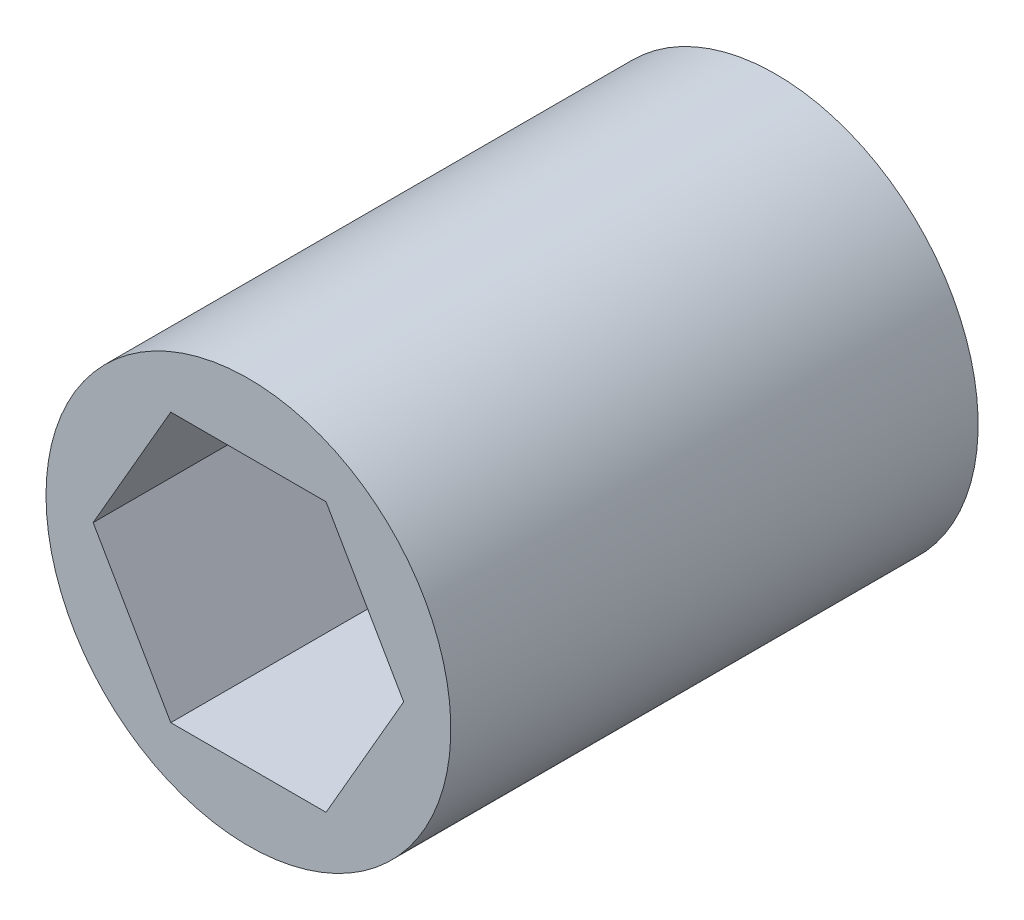
ISO-10303-21;
HEADER;
FILE_DESCRIPTION(('STEP AP214'),'2;1');
FILE_NAME('part.step','',(''),(''),'','','');
FILE_SCHEMA(('AUTOMOTIVE_DESIGN { 1 0 10303 214 1 1 1 1 }'));
ENDSEC;
DATA;
#1=APPLICATION_CONTEXT('core data for automotive mechanical design processes');
#2=APPLICATION_PROTOCOL_DEFINITION('international standard','automotive_design',2000,#1);
#3=PRODUCT_CONTEXT('',#1,'mechanical');
#4=PRODUCT('Part','Part','',(#3));
#5=PRODUCT_RELATED_PRODUCT_CATEGORY('part','',(#4));
#6=PRODUCT_DEFINITION_FORMATION('','',#4);
#7=PRODUCT_DEFINITION_CONTEXT('part definition',#1,'design');
#8=PRODUCT_DEFINITION('design','',#6,#7);
#9=PRODUCT_DEFINITION_SHAPE('','',#8);
#10=(LENGTH_UNIT() NAMED_UNIT(*) SI_UNIT(.MILLI.,.METRE.));
#11=(NAMED_UNIT(*) PLANE_ANGLE_UNIT() SI_UNIT($,.RADIAN.));
#12=(NAMED_UNIT(*) SI_UNIT($,.STERADIAN.) SOLID_ANGLE_UNIT());
#13=UNCERTAINTY_MEASURE_WITH_UNIT(LENGTH_MEASURE(1.E-05),#10,'distance_accuracy_value','');
#14=(GEOMETRIC_REPRESENTATION_CONTEXT(3) GLOBAL_UNCERTAINTY_ASSIGNED_CONTEXT((#13)) GLOBAL_UNIT_ASSIGNED_CONTEXT((#10,
#11,#12)) REPRESENTATION_CONTEXT('',''));
#15=CARTESIAN_POINT('',(0.,0.,0.));
#16=DIRECTION('',(0.,0.,1.));
#17=DIRECTION('',(1.,0.,0.));
#18=AXIS2_PLACEMENT_3D('',#15,#16,#17);
#19=CARTESIAN_POINT('',(-7.47899538708241,0.,12.7));
#20=DIRECTION('',(0.866025403784439,0.5,0.));
#21=DIRECTION('',(-0.5,0.866025403784439,0.));
#22=AXIS2_PLACEMENT_3D('',#19,#20,#21);
#23=PLANE('',#22);
#24=DIRECTION('',(-0.5,0.866025403784438,0.));
#25=VECTOR('',#24,1.);
#26=CARTESIAN_POINT('',(-3.73949769354121,-6.477,12.7));
#27=LINE('',#26,#25);
#28=CARTESIAN_POINT('',(-3.73949769354121,-6.477,12.7));
#29=VERTEX_POINT('',#28);
#30=CARTESIAN_POINT('',(-7.47899538708241,0.,12.7));
#31=VERTEX_POINT('',#30);
#32=EDGE_CURVE('E92',#29,#31,#27,.T.);
#33=ORIENTED_EDGE('',*,*,#32,.F.);
#34=DIRECTION('',(0.,0.,1.));
#35=VECTOR('',#34,1.);
#36=CARTESIAN_POINT('',(-3.73949769354121,-6.477,12.7));
#37=LINE('',#36,#35);
#38=CARTESIAN_POINT('',(-3.73949769354121,-6.477,-12.7));
#39=VERTEX_POINT('',#38);
#40=EDGE_CURVE('E84',#39,#29,#37,.T.);
#41=ORIENTED_EDGE('',*,*,#40,.F.);
#42=DIRECTION('',(-0.5,0.866025403784439,0.));
#43=VECTOR('',#42,1.);
#44=CARTESIAN_POINT('',(-3.73949769354121,-6.477,-12.7));
#45=LINE('',#44,#43);
#46=CARTESIAN_POINT('',(-7.47899538708241,0.,-12.7));
#47=VERTEX_POINT('',#46);
#48=EDGE_CURVE('E124',#39,#47,#45,.T.);
#49=ORIENTED_EDGE('',*,*,#48,.T.);
#50=DIRECTION('',(0.,0.,1.));
#51=VECTOR('',#50,1.);
#52=CARTESIAN_POINT('',(-7.47899538708241,0.,12.7));
#53=LINE('',#52,#51);
#54=EDGE_CURVE('E109',#31,#47,#53,.F.);
#55=ORIENTED_EDGE('',*,*,#54,.F.);
#56=EDGE_LOOP('',(#33,#41,#49,#55));
#57=FACE_BOUND('',#56,.T.);
#58=ADVANCED_FACE('F25',(#57),#23,.T.);
#59=CARTESIAN_POINT('',(-3.73949769354121,6.477,12.7));
#60=DIRECTION('',(0.866025403784439,-0.5,0.));
#61=DIRECTION('',(0.5,0.866025403784439,0.));
#62=AXIS2_PLACEMENT_3D('',#59,#60,#61);
#63=PLANE('',#62);
#64=DIRECTION('',(0.5,0.866025403784439,0.));
#65=VECTOR('',#64,1.);
#66=CARTESIAN_POINT('',(-7.47899538708242,0.,12.7));
#67=LINE('',#66,#65);
#68=CARTESIAN_POINT('',(-3.73949769354121,6.477,12.7));
#69=VERTEX_POINT('',#68);
#70=EDGE_CURVE('E117',#31,#69,#67,.T.);
#71=ORIENTED_EDGE('',*,*,#70,.F.);
#72=ORIENTED_EDGE('',*,*,#54,.T.);
#73=DIRECTION('',(0.5,0.866025403784439,0.));
#74=VECTOR('',#73,1.);
#75=CARTESIAN_POINT('',(-7.47899538708241,0.,-12.7));
#76=LINE('',#75,#74);
#77=CARTESIAN_POINT('',(-3.73949769354121,6.477,-12.7));
#78=VERTEX_POINT('',#77);
#79=EDGE_CURVE('E115',#47,#78,#76,.T.);
#80=ORIENTED_EDGE('',*,*,#79,.T.);
#81=DIRECTION('',(0.,0.,1.));
#82=VECTOR('',#81,1.);
#83=CARTESIAN_POINT('',(-3.73949769354121,6.477,12.7));
#84=LINE('',#83,#82);
#85=EDGE_CURVE('E106',#69,#78,#84,.F.);
#86=ORIENTED_EDGE('',*,*,#85,.F.);
#87=EDGE_LOOP('',(#71,#72,#80,#86));
#88=FACE_BOUND('',#87,.T.);
#89=ADVANCED_FACE('F114',(#88),#63,.T.);
#90=CARTESIAN_POINT('',(3.7394976935412,6.477,12.7));
#91=DIRECTION('',(0.,-1.,0.));
#92=DIRECTION('',(1.,0.,0.));
#93=AXIS2_PLACEMENT_3D('',#90,#91,#92);
#94=PLANE('',#93);
#95=DIRECTION('',(1.,0.,0.));
#96=VECTOR('',#95,1.);
#97=CARTESIAN_POINT('',(0.,6.477,12.7));
#98=LINE('',#97,#96);
#99=CARTESIAN_POINT('',(3.7394976935412,6.477,12.7));
#100=VERTEX_POINT('',#99);
#101=EDGE_CURVE('E134',#69,#100,#98,.T.);
#102=ORIENTED_EDGE('',*,*,#101,.F.);
#103=ORIENTED_EDGE('',*,*,#85,.T.);
#104=DIRECTION('',(1.,0.,0.));
#105=VECTOR('',#104,1.);
#106=CARTESIAN_POINT('',(0.,6.477,-12.7));
#107=LINE('',#106,#105);
#108=CARTESIAN_POINT('',(3.7394976935412,6.477,-12.7));
#109=VERTEX_POINT('',#108);
#110=EDGE_CURVE('E126',#78,#109,#107,.T.);
#111=ORIENTED_EDGE('',*,*,#110,.T.);
#112=DIRECTION('',(0.,0.,1.));
#113=VECTOR('',#112,1.);
#114=CARTESIAN_POINT('',(3.7394976935412,6.47700000000001,12.7));
#115=LINE('',#114,#113);
#116=EDGE_CURVE('E103',#100,#109,#115,.F.);
#117=ORIENTED_EDGE('',*,*,#116,.F.);
#118=EDGE_LOOP('',(#102,#103,#111,#117));
#119=FACE_BOUND('',#118,.T.);
#120=ADVANCED_FACE('F143',(#119),#94,.T.);
#121=CARTESIAN_POINT('',(7.47899538708241,0.,12.7));
#122=DIRECTION('',(-0.866025403784439,-0.5,0.));
#123=DIRECTION('',(0.5,-0.866025403784439,0.));
#124=AXIS2_PLACEMENT_3D('',#121,#122,#123);
#125=PLANE('',#124);
#126=DIRECTION('',(0.5,-0.866025403784438,0.));
#127=VECTOR('',#126,1.);
#128=CARTESIAN_POINT('',(3.7394976935412,6.477,12.7));
#129=LINE('',#128,#127);
#130=CARTESIAN_POINT('',(7.47899538708242,0.,12.7));
#131=VERTEX_POINT('',#130);
#132=EDGE_CURVE('E97',#100,#131,#129,.T.);
#133=ORIENTED_EDGE('',*,*,#132,.F.);
#134=ORIENTED_EDGE('',*,*,#116,.T.);
#135=DIRECTION('',(0.5,-0.866025403784438,0.));
#136=VECTOR('',#135,1.);
#137=CARTESIAN_POINT('',(3.7394976935412,6.477,-12.7));
#138=LINE('',#137,#136);
#139=CARTESIAN_POINT('',(7.47899538708241,0.,-12.7));
#140=VERTEX_POINT('',#139);
#141=EDGE_CURVE('E128',#109,#140,#138,.T.);
#142=ORIENTED_EDGE('',*,*,#141,.T.);
#143=DIRECTION('',(0.,0.,1.));
#144=VECTOR('',#143,1.);
#145=CARTESIAN_POINT('',(7.47899538708242,0.,12.7));
#146=LINE('',#145,#144);
#147=EDGE_CURVE('E73',#131,#140,#146,.F.);
#148=ORIENTED_EDGE('',*,*,#147,.F.);
#149=EDGE_LOOP('',(#133,#134,#142,#148));
#150=FACE_BOUND('',#149,.T.);
#151=ADVANCED_FACE('F140',(#150),#125,.T.);
#152=CARTESIAN_POINT('',(3.73949769354121,-6.477,12.7));
#153=DIRECTION('',(-0.866025403784439,0.5,0.));
#154=DIRECTION('',(-0.5,-0.866025403784439,0.));
#155=AXIS2_PLACEMENT_3D('',#152,#153,#154);
#156=PLANE('',#155);
#157=DIRECTION('',(-0.5,-0.866025403784439,0.));
#158=VECTOR('',#157,1.);
#159=CARTESIAN_POINT('',(7.47899538708241,0.,12.7));
#160=LINE('',#159,#158);
#161=CARTESIAN_POINT('',(3.73949769354121,-6.477,12.7));
#162=VERTEX_POINT('',#161);
#163=EDGE_CURVE('E79',#131,#162,#160,.T.);
#164=ORIENTED_EDGE('',*,*,#163,.F.);
#165=ORIENTED_EDGE('',*,*,#147,.T.);
#166=DIRECTION('',(-0.5,-0.866025403784439,0.));
#167=VECTOR('',#166,1.);
#168=CARTESIAN_POINT('',(7.47899538708241,0.,-12.7));
#169=LINE('',#168,#167);
#170=CARTESIAN_POINT('',(3.73949769354121,-6.477,-12.7));
#171=VERTEX_POINT('',#170);
#172=EDGE_CURVE('E41',#140,#171,#169,.T.);
#173=ORIENTED_EDGE('',*,*,#172,.T.);
#174=DIRECTION('',(0.,0.,1.));
#175=VECTOR('',#174,1.);
#176=CARTESIAN_POINT('',(3.73949769354121,-6.477,12.7));
#177=LINE('',#176,#175);
#178=EDGE_CURVE('E75',#162,#171,#177,.F.);
#179=ORIENTED_EDGE('',*,*,#178,.F.);
#180=EDGE_LOOP('',(#164,#165,#173,#179));
#181=FACE_BOUND('',#180,.T.);
#182=ADVANCED_FACE('F77',(#181),#156,.T.);
#183=CARTESIAN_POINT('',(-3.73949769354121,-6.477,12.7));
#184=DIRECTION('',(0.,1.,0.));
#185=DIRECTION('',(0.,0.,1.));
#186=AXIS2_PLACEMENT_3D('',#183,#184,#185);
#187=PLANE('',#186);
#188=DIRECTION('',(1.,0.,0.));
#189=VECTOR('',#188,1.);
#190=CARTESIAN_POINT('',(0.,-6.477,12.7));
#191=LINE('',#190,#189);
#192=EDGE_CURVE('E87',#162,#29,#191,.F.);
#193=ORIENTED_EDGE('',*,*,#192,.F.);
#194=ORIENTED_EDGE('',*,*,#178,.T.);
#195=DIRECTION('',(1.,0.,0.));
#196=VECTOR('',#195,1.);
#197=CARTESIAN_POINT('',(0.,-6.477,-12.7));
#198=LINE('',#197,#196);
#199=EDGE_CURVE('E136',#171,#39,#198,.F.);
#200=ORIENTED_EDGE('',*,*,#199,.T.);
#201=ORIENTED_EDGE('',*,*,#40,.T.);
#202=EDGE_LOOP('',(#193,#194,#200,#201));
#203=FACE_BOUND('',#202,.T.);
#204=ADVANCED_FACE('F88',(#203),#187,.T.);
#205=CARTESIAN_POINT('',(0.,0.,12.7));
#206=DIRECTION('',(0.,0.,1.));
#207=DIRECTION('',(1.,0.,0.));
#208=AXIS2_PLACEMENT_3D('',#205,#206,#207);
#209=PLANE('',#208);
#210=ORIENTED_EDGE('',*,*,#101,.T.);
#211=ORIENTED_EDGE('',*,*,#132,.T.);
#212=ORIENTED_EDGE('',*,*,#163,.T.);
#213=ORIENTED_EDGE('',*,*,#192,.T.);
#214=ORIENTED_EDGE('',*,*,#32,.T.);
#215=ORIENTED_EDGE('',*,*,#70,.T.);
#216=EDGE_LOOP('',(#210,#211,#212,#213,#214,#215));
#217=FACE_BOUND('',#216,.T.);
#218=CARTESIAN_POINT('',(0.,0.,12.7));
#219=DIRECTION('',(0.,0.,-1.));
#220=DIRECTION('',(-1.,0.,0.));
#221=AXIS2_PLACEMENT_3D('',#218,#219,#220);
#222=CIRCLE('',#221,9.75);
#223=CARTESIAN_POINT('',(-9.75,0.,12.7));
#224=VERTEX_POINT('',#223);
#225=EDGE_CURVE('E28',#224,#224,#222,.T.);
#226=ORIENTED_EDGE('',*,*,#225,.F.);
#227=EDGE_LOOP('',(#226));
#228=FACE_BOUND('',#227,.T.);
#229=ADVANCED_FACE('F95',(#217,#228),#209,.T.);
#230=CARTESIAN_POINT('',(0.,0.,-12.7));
#231=DIRECTION('',(0.,0.,1.));
#232=DIRECTION('',(1.,0.,0.));
#233=AXIS2_PLACEMENT_3D('',#230,#231,#232);
#234=PLANE('',#233);
#235=ORIENTED_EDGE('',*,*,#172,.F.);
#236=ORIENTED_EDGE('',*,*,#141,.F.);
#237=ORIENTED_EDGE('',*,*,#110,.F.);
#238=ORIENTED_EDGE('',*,*,#79,.F.);
#239=ORIENTED_EDGE('',*,*,#48,.F.);
#240=ORIENTED_EDGE('',*,*,#199,.F.);
#241=EDGE_LOOP('',(#235,#236,#237,#238,#239,#240));
#242=FACE_BOUND('',#241,.T.);
#243=CARTESIAN_POINT('',(0.,0.,-12.7));
#244=DIRECTION('',(0.,0.,-1.));
#245=DIRECTION('',(-1.,0.,0.));
#246=AXIS2_PLACEMENT_3D('',#243,#244,#245);
#247=CIRCLE('',#246,9.75);
#248=CARTESIAN_POINT('',(-9.75,0.,-12.7));
#249=VERTEX_POINT('',#248);
#250=EDGE_CURVE('E13',#249,#249,#247,.F.);
#251=ORIENTED_EDGE('',*,*,#250,.F.);
#252=EDGE_LOOP('',(#251));
#253=FACE_BOUND('',#252,.T.);
#254=ADVANCED_FACE('F122',(#242,#253),#234,.F.);
#255=CARTESIAN_POINT('',(0.,0.,12.7));
#256=DIRECTION('',(0.,0.,-1.));
#257=DIRECTION('',(-1.,0.,0.));
#258=AXIS2_PLACEMENT_3D('',#255,#256,#257);
#259=CYLINDRICAL_SURFACE('',#258,9.75);
#260=ORIENTED_EDGE('',*,*,#250,.T.);
#261=EDGE_LOOP('',(#260));
#262=FACE_BOUND('',#261,.T.);
#263=ORIENTED_EDGE('',*,*,#225,.T.);
#264=EDGE_LOOP('',(#263));
#265=FACE_BOUND('',#264,.T.);
#266=ADVANCED_FACE('F152',(#262,#265),#259,.T.);
#267=CLOSED_SHELL('',(#58,#89,#120,#151,#182,#204,#229,#254,#266));
#268=MANIFOLD_SOLID_BREP('B1',#267);
#269=ADVANCED_BREP_SHAPE_REPRESENTATION('',(#18,#268),#14);
#270=SHAPE_DEFINITION_REPRESENTATION(#9,#269);
ENDSEC;
END-ISO-10303-21;
